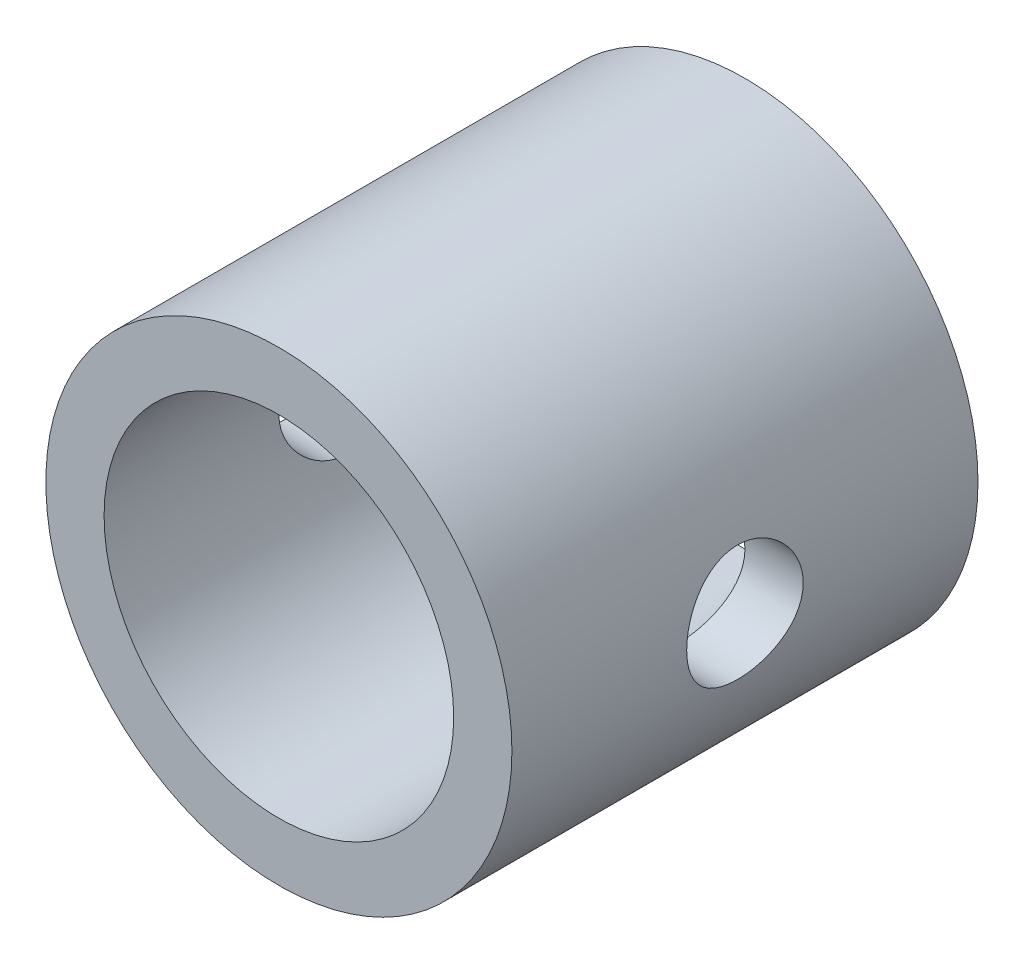
ISO-10303-21;
HEADER;
FILE_DESCRIPTION(('STEP AP214'),'2;1');
FILE_NAME('part.step','',(''),(''),'','','');
FILE_SCHEMA(('AUTOMOTIVE_DESIGN { 1 0 10303 214 1 1 1 1 }'));
ENDSEC;
DATA;
#1=APPLICATION_CONTEXT('core data for automotive mechanical design processes');
#2=APPLICATION_PROTOCOL_DEFINITION('international standard','automotive_design',2000,#1);
#3=PRODUCT_CONTEXT('',#1,'mechanical');
#4=PRODUCT('Part','Part','',(#3));
#5=PRODUCT_RELATED_PRODUCT_CATEGORY('part','',(#4));
#6=PRODUCT_DEFINITION_FORMATION('','',#4);
#7=PRODUCT_DEFINITION_CONTEXT('part definition',#1,'design');
#8=PRODUCT_DEFINITION('design','',#6,#7);
#9=PRODUCT_DEFINITION_SHAPE('','',#8);
#10=(LENGTH_UNIT() NAMED_UNIT(*) SI_UNIT(.MILLI.,.METRE.));
#11=(NAMED_UNIT(*) PLANE_ANGLE_UNIT() SI_UNIT($,.RADIAN.));
#12=(NAMED_UNIT(*) SI_UNIT($,.STERADIAN.) SOLID_ANGLE_UNIT());
#13=UNCERTAINTY_MEASURE_WITH_UNIT(LENGTH_MEASURE(1.E-05),#10,'distance_accuracy_value','');
#14=(GEOMETRIC_REPRESENTATION_CONTEXT(3) GLOBAL_UNCERTAINTY_ASSIGNED_CONTEXT((#13)) GLOBAL_UNIT_ASSIGNED_CONTEXT((#10,
#11,#12)) REPRESENTATION_CONTEXT('',''));
#15=CARTESIAN_POINT('',(0.,0.,0.));
#16=DIRECTION('',(0.,0.,1.));
#17=DIRECTION('',(1.,0.,0.));
#18=AXIS2_PLACEMENT_3D('',#15,#16,#17);
#19=CARTESIAN_POINT('',(0.,0.,20.));
#20=DIRECTION('',(0.,0.,1.));
#21=DIRECTION('',(1.,0.,0.));
#22=AXIS2_PLACEMENT_3D('',#19,#20,#21);
#23=PLANE('',#22);
#24=CARTESIAN_POINT('',(0.,0.,20.));
#25=DIRECTION('',(0.,0.,1.));
#26=DIRECTION('',(1.,0.,0.));
#27=AXIS2_PLACEMENT_3D('',#24,#25,#26);
#28=CIRCLE('',#27,10.);
#29=CARTESIAN_POINT('',(10.,0.,20.));
#30=VERTEX_POINT('',#29);
#31=EDGE_CURVE('E10',#30,#30,#28,.T.);
#32=ORIENTED_EDGE('',*,*,#31,.T.);
#33=EDGE_LOOP('',(#32));
#34=FACE_BOUND('',#33,.T.);
#35=CARTESIAN_POINT('',(0.,0.,20.));
#36=DIRECTION('',(0.,0.,1.));
#37=DIRECTION('',(1.,0.,0.));
#38=AXIS2_PLACEMENT_3D('',#35,#36,#37);
#39=CIRCLE('',#38,7.5);
#40=CARTESIAN_POINT('',(7.5,0.,20.));
#41=VERTEX_POINT('',#40);
#42=EDGE_CURVE('E49',#41,#41,#39,.T.);
#43=ORIENTED_EDGE('',*,*,#42,.F.);
#44=EDGE_LOOP('',(#43));
#45=FACE_BOUND('',#44,.T.);
#46=ADVANCED_FACE('F31',(#34,#45),#23,.T.);
#47=CARTESIAN_POINT('',(0.,0.,0.));
#48=DIRECTION('',(0.,0.,1.));
#49=DIRECTION('',(1.,0.,0.));
#50=AXIS2_PLACEMENT_3D('',#47,#48,#49);
#51=PLANE('',#50);
#52=CARTESIAN_POINT('',(0.,0.,0.));
#53=DIRECTION('',(0.,0.,1.));
#54=DIRECTION('',(1.,0.,0.));
#55=AXIS2_PLACEMENT_3D('',#52,#53,#54);
#56=CIRCLE('',#55,10.);
#57=CARTESIAN_POINT('',(10.,0.,0.));
#58=VERTEX_POINT('',#57);
#59=EDGE_CURVE('E44',#58,#58,#56,.T.);
#60=ORIENTED_EDGE('',*,*,#59,.F.);
#61=EDGE_LOOP('',(#60));
#62=FACE_BOUND('',#61,.T.);
#63=CARTESIAN_POINT('',(0.,0.,0.));
#64=DIRECTION('',(0.,0.,1.));
#65=DIRECTION('',(1.,0.,0.));
#66=AXIS2_PLACEMENT_3D('',#63,#64,#65);
#67=CIRCLE('',#66,7.5);
#68=CARTESIAN_POINT('',(7.5,0.,0.));
#69=VERTEX_POINT('',#68);
#70=EDGE_CURVE('E52',#69,#69,#67,.T.);
#71=ORIENTED_EDGE('',*,*,#70,.T.);
#72=EDGE_LOOP('',(#71));
#73=FACE_BOUND('',#72,.T.);
#74=ADVANCED_FACE('F85',(#62,#73),#51,.F.);
#75=CARTESIAN_POINT('',(0.,0.,20.));
#76=DIRECTION('',(0.,0.,-1.));
#77=DIRECTION('',(-1.,0.,0.));
#78=AXIS2_PLACEMENT_3D('',#75,#76,#77);
#79=CYLINDRICAL_SURFACE('',#78,10.);
#80=CARTESIAN_POINT('',(-10.,0.,7.50000000000001));
#81=CARTESIAN_POINT('',(-9.99999766446687,0.138126814449552,7.50000387623027));
#82=CARTESIAN_POINT('',(-9.99710963553044,0.276296929717938,7.51148591795632));
#83=CARTESIAN_POINT('',(-9.98586856383157,0.548677206284221,7.55704191884502));
#84=CARTESIAN_POINT('',(-9.97751242366627,0.682885078117899,7.59112868256309));
#85=CARTESIAN_POINT('',(-9.9562604388672,0.943368120304294,7.68073208910348));
#86=CARTESIAN_POINT('',(-9.94337004736764,1.06965260571667,7.73622299785879));
#87=CARTESIAN_POINT('',(-9.91442239679369,1.31112021984071,7.86696898340808));
#88=CARTESIAN_POINT('',(-9.89836503090261,1.4263029739146,7.94222472686495));
#89=CARTESIAN_POINT('',(-9.86445689319489,1.64466987883486,8.11200131609031));
#90=CARTESIAN_POINT('',(-9.84657845246877,1.74759281676843,8.20685262493178));
#91=CARTESIAN_POINT('',(-9.8112270019656,1.93624821200553,8.41242034151506));
#92=CARTESIAN_POINT('',(-9.79375403816446,2.02197872824865,8.5231385382449));
#93=CARTESIAN_POINT('',(-9.76091292830281,2.17504423799829,8.75932537789499));
#94=CARTESIAN_POINT('',(-9.74557990774685,2.2420870265419,8.88498871801455));
#95=CARTESIAN_POINT('',(-9.71915824696694,2.35399484758457,9.14624735276673));
#96=CARTESIAN_POINT('',(-9.70806892824031,2.39886342573357,9.28184105555336));
#97=CARTESIAN_POINT('',(-9.69167461160538,2.46425806134127,9.55623916366944));
#98=CARTESIAN_POINT('',(-9.68625818328352,2.48525378055342,9.69492482672999));
#99=CARTESIAN_POINT('',(-9.68148937432652,2.50376962511068,9.97394761499891));
#100=CARTESIAN_POINT('',(-9.68213600713214,2.50129356969685,10.1142844678202));
#101=CARTESIAN_POINT('',(-9.68932009194695,2.47331087439951,10.3890263462423));
#102=CARTESIAN_POINT('',(-9.69571438345489,2.44836390031772,10.5234927024422));
#103=CARTESIAN_POINT('',(-9.71344516118448,2.37704031150499,10.7862684181851));
#104=CARTESIAN_POINT('',(-9.72478199948731,2.33066217011565,10.9145773383815));
#105=CARTESIAN_POINT('',(-9.75125189842765,2.21731579656197,11.1628966937536));
#106=CARTESIAN_POINT('',(-9.76642212449693,2.1501444453882,11.282810286316));
#107=CARTESIAN_POINT('',(-9.79882851409985,1.99726046002491,11.5098645162614));
#108=CARTESIAN_POINT('',(-9.81606503891047,1.91154458134806,11.6170029134454));
#109=CARTESIAN_POINT('',(-9.85126467566486,1.72110570780203,11.818672692824));
#110=CARTESIAN_POINT('',(-9.86923449130002,1.61591043027643,11.9127574834356));
#111=CARTESIAN_POINT('',(-9.90343275964594,1.39101986250617,12.0820354041065));
#112=CARTESIAN_POINT('',(-9.91966115915679,1.27132412951324,12.1572279571059));
#113=CARTESIAN_POINT('',(-9.94862886823651,1.02019314780232,12.2867509770406));
#114=CARTESIAN_POINT('',(-9.96135600212879,0.888718988681039,12.3410089004241));
#115=CARTESIAN_POINT('',(-9.98179861652361,0.618126680238138,12.4265288428493));
#116=CARTESIAN_POINT('',(-9.98951505565468,0.479009998584141,12.4577952606969));
#117=CARTESIAN_POINT('',(-9.99892498785624,0.200899950650045,12.4957626092647));
#118=CARTESIAN_POINT('',(-10.0007675584713,0.0619945333136834,12.5030717101255));
#119=CARTESIAN_POINT('',(-9.99864674690754,-0.215054791335847,12.4945849965742));
#120=CARTESIAN_POINT('',(-9.99468388736421,-0.353198766074327,12.4787912620014));
#121=CARTESIAN_POINT('',(-9.98149301878918,-0.622690447960816,12.4250484860144));
#122=CARTESIAN_POINT('',(-9.97234390309647,-0.754108531614582,12.3874312275384));
#123=CARTESIAN_POINT('',(-9.94981177723595,-1.00876215408752,12.2914881932859));
#124=CARTESIAN_POINT('',(-9.93642833949965,-1.13199686505442,12.2331603261446));
#125=CARTESIAN_POINT('',(-9.9065551321037,-1.36920522404972,12.0962731185422));
#126=CARTESIAN_POINT('',(-9.89001445610999,-1.48297573639294,12.0173731460057));
#127=CARTESIAN_POINT('',(-9.85574181979586,-1.69587768940551,11.8420168186714));
#128=CARTESIAN_POINT('',(-9.83800965421578,-1.79500659828874,11.7455574339706));
#129=CARTESIAN_POINT('',(-9.80281594932498,-1.97831761345414,11.5349967319272));
#130=CARTESIAN_POINT('',(-9.78537173637463,-2.06207311270184,11.4205204950007));
#131=CARTESIAN_POINT('',(-9.75321463970069,-2.20918459835604,11.1787789425524));
#132=CARTESIAN_POINT('',(-9.73850163474941,-2.27254149026901,11.0515141950493));
#133=CARTESIAN_POINT('',(-9.71363491194665,-2.37658570101223,10.7884904626563));
#134=CARTESIAN_POINT('',(-9.70345425375809,-2.41740732773931,10.6527872861462));
#135=CARTESIAN_POINT('',(-9.68877906706586,-2.47557609990489,10.3761506035745));
#136=CARTESIAN_POINT('',(-9.68428329504044,-2.49292837912652,10.2352182482976));
#137=CARTESIAN_POINT('',(-9.68158168701612,-2.50339765056083,9.95646496023066));
#138=CARTESIAN_POINT('',(-9.68319887888035,-2.49719649630131,9.81867094145593));
#139=CARTESIAN_POINT('',(-9.69213181672143,-2.46229546385366,9.54616018555623));
#140=CARTESIAN_POINT('',(-9.69944744817731,-2.43359603781098,9.41144338664468));
#141=CARTESIAN_POINT('',(-9.71885434473222,-2.35488553240495,9.14965256822357));
#142=CARTESIAN_POINT('',(-9.73091692061057,-2.30500234113404,9.02253782459946));
#143=CARTESIAN_POINT('',(-9.7584625954084,-2.18544152267504,8.77839102881073));
#144=CARTESIAN_POINT('',(-9.77394616867808,-2.11576115005696,8.66136037802187));
#145=CARTESIAN_POINT('',(-9.80709390439338,-1.95644624772858,8.43740895166325));
#146=CARTESIAN_POINT('',(-9.82480441386302,-1.86633860485376,8.33083154429339));
#147=CARTESIAN_POINT('',(-9.86013378743769,-1.66964895198289,8.13408825867434));
#148=CARTESIAN_POINT('',(-9.87775262878422,-1.56306303543524,8.04392628314506));
#149=CARTESIAN_POINT('',(-9.91129426079449,-1.33411264450432,7.88098115239232));
#150=CARTESIAN_POINT('',(-9.92718055609783,-1.21149737052731,7.80854231054738));
#151=CARTESIAN_POINT('',(-9.95508208291861,-0.95544343251746,7.68542089509913));
#152=CARTESIAN_POINT('',(-9.96710008666301,-0.822012605727899,7.63472273225245));
#153=CARTESIAN_POINT('',(-9.98413432609236,-0.57401708873912,7.56404694945058));
#154=CARTESIAN_POINT('',(-9.99004308421151,-0.460633618180114,7.54008126157762));
#155=CARTESIAN_POINT('',(-9.9979767538658,-0.231510119227139,7.5080567606301));
#156=CARTESIAN_POINT('',(-10.0000019575149,-0.115770268737694,7.49999675115784));
#157=CARTESIAN_POINT('',(-10.,0.,7.50000000000001));
#158=B_SPLINE_CURVE_WITH_KNOTS('',3,(#80,#81,#82,#83,#84,#85,#86,#87,#88,#89,#90,#91,#92,#93,
#94,#95,#96,#97,#98,#99,#100,#101,#102,#103,#104,#105,#106,#107,#108,#109,#110,#111,#112,#113,
#114,#115,#116,#117,#118,#119,#120,#121,#122,#123,#124,#125,#126,#127,#128,#129,#130,#131,#132,
#133,#134,#135,#136,#137,#138,#139,#140,#141,#142,#143,#144,#145,#146,#147,#148,#149,#150,#151,
#152,#153,#154,#155,#156,#157),.UNSPECIFIED.,.T.,.F.,(4,2,2,2,2,2,2,2,2,2,2,2,2,2,2,2,2,2,2,2,2,
2,2,2,2,2,2,2,2,2,2,2,2,2,2,2,2,2,4),(0.,0.413956187453149,0.828147062939832,1.24184150381018,
1.65554990028221,2.07690725728565,2.4983121596677,2.92597745909678,3.3535743528228,
3.77260491835116,4.19156730193362,4.60037495017231,5.00921172448931,5.42217546461999,
5.83521151399139,6.26002501620566,6.68485149269279,7.11113715020724,7.53734122819939,
7.95263848254328,8.36789835193438,8.77700457528929,9.18615212209351,9.6025597928112,
10.0190393835223,10.4457418201299,10.8724253125471,11.2965375769763,11.7205570543048,
12.1323963400748,12.5442273493652,12.9536066760887,13.3630428023796,13.7831596069298,
14.2033761629383,14.6312030917578,15.0587227304538,15.4057040491338,15.7526592674819),.UNSPECIFIED.);
#159=CARTESIAN_POINT('',(-10.,0.,7.50000000000001));
#160=VERTEX_POINT('',#159);
#161=EDGE_CURVE('E75',#160,#160,#158,.T.);
#162=ORIENTED_EDGE('',*,*,#161,.T.);
#163=EDGE_LOOP('',(#162));
#164=FACE_BOUND('',#163,.T.);
#165=CARTESIAN_POINT('',(10.,0.,7.50000000000001));
#166=CARTESIAN_POINT('',(9.99999766446687,-0.138126814449552,7.50000387623027));
#167=CARTESIAN_POINT('',(9.99710963553044,-0.276296929717938,7.51148591795632));
#168=CARTESIAN_POINT('',(9.98586856383157,-0.548677206284221,7.55704191884502));
#169=CARTESIAN_POINT('',(9.97751242366627,-0.682885078117899,7.59112868256309));
#170=CARTESIAN_POINT('',(9.9562604388672,-0.943368120304294,7.68073208910348));
#171=CARTESIAN_POINT('',(9.94337004736764,-1.06965260571667,7.73622299785879));
#172=CARTESIAN_POINT('',(9.91442239679369,-1.31112021984071,7.86696898340808));
#173=CARTESIAN_POINT('',(9.89836503090261,-1.4263029739146,7.94222472686495));
#174=CARTESIAN_POINT('',(9.86445689319489,-1.64466987883486,8.11200131609031));
#175=CARTESIAN_POINT('',(9.84657845246877,-1.74759281676843,8.20685262493178));
#176=CARTESIAN_POINT('',(9.8112270019656,-1.93624821200553,8.41242034151506));
#177=CARTESIAN_POINT('',(9.79375403816446,-2.02197872824865,8.5231385382449));
#178=CARTESIAN_POINT('',(9.76091292830281,-2.17504423799829,8.75932537789499));
#179=CARTESIAN_POINT('',(9.74557990774685,-2.2420870265419,8.88498871801455));
#180=CARTESIAN_POINT('',(9.71915824696694,-2.35399484758457,9.14624735276673));
#181=CARTESIAN_POINT('',(9.70806892824031,-2.39886342573357,9.28184105555336));
#182=CARTESIAN_POINT('',(9.69167461160538,-2.46425806134127,9.55623916366944));
#183=CARTESIAN_POINT('',(9.68625818328352,-2.48525378055342,9.69492482672999));
#184=CARTESIAN_POINT('',(9.68148937432652,-2.50376962511068,9.97394761499891));
#185=CARTESIAN_POINT('',(9.68213600713214,-2.50129356969685,10.1142844678202));
#186=CARTESIAN_POINT('',(9.68932009194695,-2.47331087439951,10.3890263462423));
#187=CARTESIAN_POINT('',(9.69571438345489,-2.44836390031772,10.5234927024422));
#188=CARTESIAN_POINT('',(9.71344516118448,-2.37704031150499,10.7862684181851));
#189=CARTESIAN_POINT('',(9.72478199948731,-2.33066217011565,10.9145773383815));
#190=CARTESIAN_POINT('',(9.75125189842765,-2.21731579656197,11.1628966937536));
#191=CARTESIAN_POINT('',(9.76642212449693,-2.1501444453882,11.282810286316));
#192=CARTESIAN_POINT('',(9.79882851409985,-1.99726046002491,11.5098645162614));
#193=CARTESIAN_POINT('',(9.81606503891047,-1.91154458134806,11.6170029134454));
#194=CARTESIAN_POINT('',(9.85126467566486,-1.72110570780203,11.818672692824));
#195=CARTESIAN_POINT('',(9.86923449130002,-1.61591043027643,11.9127574834356));
#196=CARTESIAN_POINT('',(9.90343275964594,-1.39101986250617,12.0820354041065));
#197=CARTESIAN_POINT('',(9.91966115915679,-1.27132412951324,12.1572279571059));
#198=CARTESIAN_POINT('',(9.94862886823651,-1.02019314780232,12.2867509770406));
#199=CARTESIAN_POINT('',(9.96135600212879,-0.888718988681039,12.3410089004241));
#200=CARTESIAN_POINT('',(9.98179861652361,-0.618126680238138,12.4265288428493));
#201=CARTESIAN_POINT('',(9.98951505565468,-0.479009998584141,12.4577952606969));
#202=CARTESIAN_POINT('',(9.99892498785624,-0.200899950650045,12.4957626092647));
#203=CARTESIAN_POINT('',(10.0007675584713,-0.0619945333136834,12.5030717101255));
#204=CARTESIAN_POINT('',(9.99864674690754,0.215054791335847,12.4945849965742));
#205=CARTESIAN_POINT('',(9.99468388736421,0.353198766074327,12.4787912620014));
#206=CARTESIAN_POINT('',(9.98149301878918,0.622690447960816,12.4250484860144));
#207=CARTESIAN_POINT('',(9.97234390309647,0.754108531614582,12.3874312275384));
#208=CARTESIAN_POINT('',(9.94981177723595,1.00876215408752,12.2914881932859));
#209=CARTESIAN_POINT('',(9.93642833949965,1.13199686505442,12.2331603261446));
#210=CARTESIAN_POINT('',(9.9065551321037,1.36920522404972,12.0962731185422));
#211=CARTESIAN_POINT('',(9.89001445610999,1.48297573639294,12.0173731460057));
#212=CARTESIAN_POINT('',(9.85574181979586,1.69587768940551,11.8420168186714));
#213=CARTESIAN_POINT('',(9.83800965421578,1.79500659828874,11.7455574339706));
#214=CARTESIAN_POINT('',(9.80281594932498,1.97831761345414,11.5349967319272));
#215=CARTESIAN_POINT('',(9.78537173637463,2.06207311270184,11.4205204950007));
#216=CARTESIAN_POINT('',(9.75321463970069,2.20918459835604,11.1787789425524));
#217=CARTESIAN_POINT('',(9.73850163474941,2.27254149026901,11.0515141950493));
#218=CARTESIAN_POINT('',(9.71363491194665,2.37658570101223,10.7884904626563));
#219=CARTESIAN_POINT('',(9.70345425375809,2.41740732773931,10.6527872861462));
#220=CARTESIAN_POINT('',(9.68877906706586,2.47557609990489,10.3761506035745));
#221=CARTESIAN_POINT('',(9.68428329504044,2.49292837912652,10.2352182482976));
#222=CARTESIAN_POINT('',(9.68158168701612,2.50339765056083,9.95646496023066));
#223=CARTESIAN_POINT('',(9.68319887888035,2.49719649630131,9.81867094145593));
#224=CARTESIAN_POINT('',(9.69213181672143,2.46229546385366,9.54616018555623));
#225=CARTESIAN_POINT('',(9.69944744817731,2.43359603781098,9.41144338664468));
#226=CARTESIAN_POINT('',(9.71885434473222,2.35488553240495,9.14965256822357));
#227=CARTESIAN_POINT('',(9.73091692061057,2.30500234113404,9.02253782459946));
#228=CARTESIAN_POINT('',(9.7584625954084,2.18544152267504,8.77839102881073));
#229=CARTESIAN_POINT('',(9.77394616867808,2.11576115005696,8.66136037802187));
#230=CARTESIAN_POINT('',(9.80709390439338,1.95644624772858,8.43740895166325));
#231=CARTESIAN_POINT('',(9.82480441386302,1.86633860485376,8.33083154429339));
#232=CARTESIAN_POINT('',(9.86013378743769,1.66964895198289,8.13408825867434));
#233=CARTESIAN_POINT('',(9.87775262878422,1.56306303543524,8.04392628314506));
#234=CARTESIAN_POINT('',(9.91129426079449,1.33411264450432,7.88098115239232));
#235=CARTESIAN_POINT('',(9.92718055609783,1.21149737052731,7.80854231054738));
#236=CARTESIAN_POINT('',(9.95508208291861,0.95544343251746,7.68542089509913));
#237=CARTESIAN_POINT('',(9.96710008666301,0.822012605727899,7.63472273225245));
#238=CARTESIAN_POINT('',(9.98413432609236,0.57401708873912,7.56404694945058));
#239=CARTESIAN_POINT('',(9.99004308421151,0.460633618180114,7.54008126157762));
#240=CARTESIAN_POINT('',(9.9979767538658,0.231510119227139,7.5080567606301));
#241=CARTESIAN_POINT('',(10.0000019575149,0.115770268737694,7.49999675115784));
#242=CARTESIAN_POINT('',(10.,0.,7.50000000000001));
#243=B_SPLINE_CURVE_WITH_KNOTS('',3,(#165,#166,#167,#168,#169,#170,#171,#172,#173,#174,#175,
#176,#177,#178,#179,#180,#181,#182,#183,#184,#185,#186,#187,#188,#189,#190,#191,#192,#193,#194,
#195,#196,#197,#198,#199,#200,#201,#202,#203,#204,#205,#206,#207,#208,#209,#210,#211,#212,#213,
#214,#215,#216,#217,#218,#219,#220,#221,#222,#223,#224,#225,#226,#227,#228,#229,#230,#231,#232,
#233,#234,#235,#236,#237,#238,#239,#240,#241,#242),.UNSPECIFIED.,.T.,.F.,(4,2,2,2,2,2,2,2,2,2,2,
2,2,2,2,2,2,2,2,2,2,2,2,2,2,2,2,2,2,2,2,2,2,2,2,2,2,2,4),(0.,0.413956187453149,
0.828147062939832,1.24184150381018,1.65554990028221,2.07690725728565,2.4983121596677,
2.92597745909678,3.3535743528228,3.77260491835116,4.19156730193362,4.60037495017231,
5.00921172448931,5.42217546461999,5.83521151399139,6.26002501620566,6.68485149269279,
7.11113715020724,7.53734122819939,7.95263848254328,8.36789835193438,8.77700457528929,
9.18615212209351,9.6025597928112,10.0190393835223,10.4457418201299,10.8724253125471,
11.2965375769763,11.7205570543048,12.1323963400748,12.5442273493652,12.9536066760887,
13.3630428023796,13.7831596069298,14.2033761629383,14.6312030917578,15.0587227304538,
15.4057040491338,15.7526592674819),.UNSPECIFIED.);
#244=CARTESIAN_POINT('',(10.,0.,7.50000000000001));
#245=VERTEX_POINT('',#244);
#246=EDGE_CURVE('E71',#245,#245,#243,.T.);
#247=ORIENTED_EDGE('',*,*,#246,.T.);
#248=EDGE_LOOP('',(#247));
#249=FACE_BOUND('',#248,.T.);
#250=ORIENTED_EDGE('',*,*,#31,.F.);
#251=EDGE_LOOP('',(#250));
#252=FACE_BOUND('',#251,.T.);
#253=ORIENTED_EDGE('',*,*,#59,.T.);
#254=EDGE_LOOP('',(#253));
#255=FACE_BOUND('',#254,.T.);
#256=ADVANCED_FACE('F33',(#164,#249,#252,#255),#79,.T.);
#257=CARTESIAN_POINT('',(0.,0.,20.));
#258=DIRECTION('',(0.,0.,-1.));
#259=DIRECTION('',(-1.,0.,0.));
#260=AXIS2_PLACEMENT_3D('',#257,#258,#259);
#261=CYLINDRICAL_SURFACE('',#260,7.5);
#262=CARTESIAN_POINT('',(-7.5,0.,12.5));
#263=CARTESIAN_POINT('',(-7.5000003825236,-0.136408407216808,12.5000006343291));
#264=CARTESIAN_POINT('',(-7.49624423768862,-0.272812986346375,12.488799334682));
#265=CARTESIAN_POINT('',(-7.48163025508202,-0.54160440218243,12.444427227957));
#266=CARTESIAN_POINT('',(-7.47077168005381,-0.673990820297044,12.4112541401277));
#267=CARTESIAN_POINT('',(-7.44313269766107,-0.93083197375444,12.3242018915399));
#268=CARTESIAN_POINT('',(-7.42636219327133,-1.05529956471509,12.2703573438518));
#269=CARTESIAN_POINT('',(-7.38861114293354,-1.29343734201331,12.1436470679041));
#270=CARTESIAN_POINT('',(-7.36762976669445,-1.40710539239676,12.0707775874935));
#271=CARTESIAN_POINT('',(-7.32285236107513,-1.62435418755566,11.9054354878531));
#272=CARTESIAN_POINT('',(-7.29898891159462,-1.72750925074577,11.8124219143488));
#273=CARTESIAN_POINT('',(-7.25150786957804,-1.91708173175521,11.6105821132336));
#274=CARTESIAN_POINT('',(-7.22789033226373,-2.00349546372365,11.5017524126787));
#275=CARTESIAN_POINT('',(-7.18283331193184,-2.15956235556965,11.2675372120089));
#276=CARTESIAN_POINT('',(-7.1614759818922,-2.22866214555258,11.1417656506697));
#277=CARTESIAN_POINT('',(-7.12438263546503,-2.3445471846943,10.8795597638536));
#278=CARTESIAN_POINT('',(-7.10864490401864,-2.39133924346691,10.7431287070931));
#279=CARTESIAN_POINT('',(-7.08528258173443,-2.45968365377291,10.4683169462582));
#280=CARTESIAN_POINT('',(-7.07740239424028,-2.48203362067942,10.3301569787773));
#281=CARTESIAN_POINT('',(-7.06989141573769,-2.50335280833619,10.0518406146103));
#282=CARTESIAN_POINT('',(-7.07025807556825,-2.50232925401179,9.91168484822703));
#283=CARTESIAN_POINT('',(-7.0789753752045,-2.47754975925855,9.64015842388995));
#284=CARTESIAN_POINT('',(-7.08696039668832,-2.45483478291749,9.50867899270246));
#285=CARTESIAN_POINT('',(-7.10941644311377,-2.38901540712354,9.25151645098292));
#286=CARTESIAN_POINT('',(-7.12388824460269,-2.34590856647968,9.12583403641233));
#287=CARTESIAN_POINT('',(-7.15794777828122,-2.23984764515053,8.88146812602131));
#288=CARTESIAN_POINT('',(-7.17761414482793,-2.17658512176815,8.76292993632619));
#289=CARTESIAN_POINT('',(-7.21981396439316,-2.03222276575785,8.53782272930069));
#290=CARTESIAN_POINT('',(-7.24234824476159,-1.95111778091001,8.43125718266655));
#291=CARTESIAN_POINT('',(-7.28918322919352,-1.76837333170559,8.22727100459807));
#292=CARTESIAN_POINT('',(-7.31351473387107,-1.66588287519078,8.13061826372733));
#293=CARTESIAN_POINT('',(-7.36017345967592,-1.44584892492516,7.95567183334151));
#294=CARTESIAN_POINT('',(-7.38250048845168,-1.32830398915204,7.87737990458877));
#295=CARTESIAN_POINT('',(-7.42292769844484,-1.07986903261567,7.74075924941233));
#296=CARTESIAN_POINT('',(-7.44098375020098,-0.948858191040841,7.68263627164818));
#297=CARTESIAN_POINT('',(-7.47051417861087,-0.678172708411268,7.58949206511073));
#298=CARTESIAN_POINT('',(-7.48199084137198,-0.538501095387384,7.55446281144141));
#299=CARTESIAN_POINT('',(-7.49669067678601,-0.26095957382326,7.50986083494411));
#300=CARTESIAN_POINT('',(-7.5002500458432,-0.123273999662115,7.49925047706813));
#301=CARTESIAN_POINT('',(-7.49972256737068,0.151937674900594,7.50083168399618));
#302=CARTESIAN_POINT('',(-7.49563701048406,0.289463798299126,7.5130193999497));
#303=CARTESIAN_POINT('',(-7.48050061792761,0.556299665760639,7.5590297693399));
#304=CARTESIAN_POINT('',(-7.46965496777981,0.685732017087109,7.59221551512374));
#305=CARTESIAN_POINT('',(-7.44229617075175,0.937139896448934,7.67848361116683));
#306=CARTESIAN_POINT('',(-7.42578230116688,1.05911447127152,7.73156849866947));
#307=CARTESIAN_POINT('',(-7.38822328218224,1.29572074098318,7.85767607960197));
#308=CARTESIAN_POINT('',(-7.36707036889465,1.41007489804287,7.93118648320793));
#309=CARTESIAN_POINT('',(-7.32263134790656,1.62516207533896,8.09548537503372));
#310=CARTESIAN_POINT('',(-7.29934458984569,1.72589091948894,8.18627914007942));
#311=CARTESIAN_POINT('',(-7.25192119951112,1.91563126951575,8.38744687751648));
#312=CARTESIAN_POINT('',(-7.2277940271857,2.00390242311443,8.49852306731716));
#313=CARTESIAN_POINT('',(-7.18249933236772,2.16064380580894,8.73442891952722));
#314=CARTESIAN_POINT('',(-7.16133183455006,2.22911386982753,8.8592586965852));
#315=CARTESIAN_POINT('',(-7.12455979478459,2.3439923260409,9.11918253822475));
#316=CARTESIAN_POINT('',(-7.10894401982447,2.39044533041255,9.25425519792192));
#317=CARTESIAN_POINT('',(-7.08527080766124,2.45973666689839,9.53094662511033));
#318=CARTESIAN_POINT('',(-7.07720996559098,2.48258563738485,9.67256241351088));
#319=CARTESIAN_POINT('',(-7.06994647185443,2.50319070619335,9.95049274010229));
#320=CARTESIAN_POINT('',(-7.07031000643538,2.502175643271,10.0867058507171));
#321=CARTESIAN_POINT('',(-7.07878174559669,2.47810573362173,10.3569126873052));
#322=CARTESIAN_POINT('',(-7.08688948923404,2.45505219864646,10.4909065448877));
#323=CARTESIAN_POINT('',(-7.10961310762229,2.38842953282336,10.7503391575062));
#324=CARTESIAN_POINT('',(-7.12410245056194,2.34525836503878,10.8758920625112));
#325=CARTESIAN_POINT('',(-7.15790997046171,2.23994841439937,11.1180685173457));
#326=CARTESIAN_POINT('',(-7.17722921908483,2.17780542138451,11.23469007797));
#327=CARTESIAN_POINT('',(-7.21957073065116,2.03315173145857,11.4612091748073));
#328=CARTESIAN_POINT('',(-7.24271779105343,1.94987060691145,11.570591254746));
#329=CARTESIAN_POINT('',(-7.28958390708132,1.76660720783912,11.7742245334605));
#330=CARTESIAN_POINT('',(-7.31330312280931,1.6666202111287,11.8684714392202));
#331=CARTESIAN_POINT('',(-7.3597507631386,1.44810389230172,12.0428610307229));
#332=CARTESIAN_POINT('',(-7.38240454503142,1.32900378374932,12.1223108693775));
#333=CARTESIAN_POINT('',(-7.4231497793153,1.07839339351656,12.2599760721266));
#334=CARTESIAN_POINT('',(-7.44124239769824,0.946886295330872,12.3181968648051));
#335=CARTESIAN_POINT('',(-7.47013787671354,0.68123411800244,12.4093040812217));
#336=CARTESIAN_POINT('',(-7.48123031056307,0.547469394191022,12.4432061656584));
#337=CARTESIAN_POINT('',(-7.49616017660555,0.275801040025618,12.4885507016928));
#338=CARTESIAN_POINT('',(-7.49999961329762,0.137898563921866,12.4999993587413));
#339=CARTESIAN_POINT('',(-7.5,0.,12.5));
#340=B_SPLINE_CURVE_WITH_KNOTS('',3,(#262,#263,#264,#265,#266,#267,#268,#269,#270,#271,#272,
#273,#274,#275,#276,#277,#278,#279,#280,#281,#282,#283,#284,#285,#286,#287,#288,#289,#290,#291,
#292,#293,#294,#295,#296,#297,#298,#299,#300,#301,#302,#303,#304,#305,#306,#307,#308,#309,#310,
#311,#312,#313,#314,#315,#316,#317,#318,#319,#320,#321,#322,#323,#324,#325,#326,#327,#328,#329,
#330,#331,#332,#333,#334,#335,#336,#337,#338,#339),.UNSPECIFIED.,.T.,.F.,(4,2,2,2,2,2,2,2,2,2,2,
2,2,2,2,2,2,2,2,2,2,2,2,2,2,2,2,2,2,2,2,2,2,2,2,2,2,2,4),(0.,0.408717765065027,
0.817477963168801,1.22555668217568,1.63371594449775,2.0546171070689,2.47561083218825,
2.90870962058676,3.34167611732083,3.760048143546,4.17829084968713,4.577420663782,
4.97659827138705,5.38220427887826,5.78792756395518,6.21483264528417,6.64177864916546,
7.07296014125894,7.5039917219302,7.91633957937924,8.32861782910441,8.72895394945533,
9.12934113210259,9.54025999609341,9.95130452054727,10.3810255720188,10.8107502058749,
11.2396003456693,11.668257117646,12.0748916516064,12.4815019837844,12.8803896770104,
13.2793659543994,13.6957516672951,14.1122552780945,14.5449915208775,14.9776170288114,
15.3909139593453,15.8040966509535),.UNSPECIFIED.);
#341=CARTESIAN_POINT('',(-7.5,0.,12.5));
#342=VERTEX_POINT('',#341);
#343=EDGE_CURVE('E36',#342,#342,#340,.T.);
#344=ORIENTED_EDGE('',*,*,#343,.F.);
#345=EDGE_LOOP('',(#344));
#346=FACE_BOUND('',#345,.T.);
#347=CARTESIAN_POINT('',(7.5,0.,7.50000000000001));
#348=CARTESIAN_POINT('',(7.5000003825236,-0.136408407216808,7.4999993656709));
#349=CARTESIAN_POINT('',(7.49624423768862,-0.272812986346374,7.51120066531805));
#350=CARTESIAN_POINT('',(7.48163025508202,-0.54160440218243,7.55557277204305));
#351=CARTESIAN_POINT('',(7.47077168005381,-0.673990820297044,7.58874585987231));
#352=CARTESIAN_POINT('',(7.44313269766107,-0.930831973754439,7.67579810846013));
#353=CARTESIAN_POINT('',(7.42636219327133,-1.05529956471508,7.72964265614819));
#354=CARTESIAN_POINT('',(7.38861114293354,-1.29343734201331,7.85635293209587));
#355=CARTESIAN_POINT('',(7.36762976669445,-1.40710539239676,7.92922241250651));
#356=CARTESIAN_POINT('',(7.32285236107513,-1.62435418755566,8.09456451214689));
#357=CARTESIAN_POINT('',(7.29898891159462,-1.72750925074577,8.18757808565124));
#358=CARTESIAN_POINT('',(7.25150786957804,-1.91708173175521,8.38941788676642));
#359=CARTESIAN_POINT('',(7.22789033226373,-2.00349546372366,8.49824758732129));
#360=CARTESIAN_POINT('',(7.18283331193184,-2.15956235556965,8.73246278799115));
#361=CARTESIAN_POINT('',(7.1614759818922,-2.22866214555258,8.85823434933031));
#362=CARTESIAN_POINT('',(7.12438263546503,-2.3445471846943,9.12044023614637));
#363=CARTESIAN_POINT('',(7.10864490401864,-2.39133924346691,9.25687129290687));
#364=CARTESIAN_POINT('',(7.08528258173443,-2.45968365377291,9.53168305374178));
#365=CARTESIAN_POINT('',(7.07740239424028,-2.48203362067942,9.66984302122266));
#366=CARTESIAN_POINT('',(7.06989141573769,-2.50335280833619,9.94815938538971));
#367=CARTESIAN_POINT('',(7.07025807556825,-2.50232925401179,10.088315151773));
#368=CARTESIAN_POINT('',(7.0789753752045,-2.47754975925855,10.3598415761101));
#369=CARTESIAN_POINT('',(7.08696039668832,-2.45483478291749,10.4913210072976));
#370=CARTESIAN_POINT('',(7.10941644311377,-2.38901540712354,10.7484835490171));
#371=CARTESIAN_POINT('',(7.12388824460269,-2.34590856647968,10.8741659635877));
#372=CARTESIAN_POINT('',(7.15794777828122,-2.23984764515053,11.1185318739787));
#373=CARTESIAN_POINT('',(7.17761414482793,-2.17658512176815,11.2370700636738));
#374=CARTESIAN_POINT('',(7.21981396439316,-2.03222276575785,11.4621772706993));
#375=CARTESIAN_POINT('',(7.24234824476159,-1.95111778091001,11.5687428173335));
#376=CARTESIAN_POINT('',(7.28918322919352,-1.76837333170559,11.7727289954019));
#377=CARTESIAN_POINT('',(7.31351473387107,-1.66588287519078,11.8693817362727));
#378=CARTESIAN_POINT('',(7.36017345967592,-1.44584892492516,12.0443281666585));
#379=CARTESIAN_POINT('',(7.38250048845168,-1.32830398915203,12.1226200954112));
#380=CARTESIAN_POINT('',(7.42292769844484,-1.07986903261567,12.2592407505877));
#381=CARTESIAN_POINT('',(7.44098375020098,-0.94885819104084,12.3173637283518));
#382=CARTESIAN_POINT('',(7.47051417861087,-0.678172708411267,12.4105079348893));
#383=CARTESIAN_POINT('',(7.48199084137198,-0.538501095387382,12.4455371885586));
#384=CARTESIAN_POINT('',(7.49669067678601,-0.260959573823259,12.4901391650559));
#385=CARTESIAN_POINT('',(7.5002500458432,-0.123273999662114,12.5007495229319));
#386=CARTESIAN_POINT('',(7.49972256737068,0.151937674900594,12.4991683160038));
#387=CARTESIAN_POINT('',(7.49563701048406,0.289463798299127,12.4869806000503));
#388=CARTESIAN_POINT('',(7.48050061792761,0.556299665760639,12.4409702306601));
#389=CARTESIAN_POINT('',(7.46965496777981,0.685732017087109,12.4077844848763));
#390=CARTESIAN_POINT('',(7.44229617075175,0.937139896448934,12.3215163888332));
#391=CARTESIAN_POINT('',(7.42578230116688,1.05911447127152,12.2684315013305));
#392=CARTESIAN_POINT('',(7.38822328218224,1.29572074098318,12.142323920398));
#393=CARTESIAN_POINT('',(7.36707036889465,1.41007489804287,12.0688135167921));
#394=CARTESIAN_POINT('',(7.32263134790656,1.62516207533897,11.9045146249663));
#395=CARTESIAN_POINT('',(7.29934458984569,1.72589091948894,11.8137208599206));
#396=CARTESIAN_POINT('',(7.25192119951112,1.91563126951575,11.6125531224835));
#397=CARTESIAN_POINT('',(7.2277940271857,2.00390242311443,11.5014769326829));
#398=CARTESIAN_POINT('',(7.18249933236772,2.16064380580894,11.2655710804728));
#399=CARTESIAN_POINT('',(7.16133183455006,2.22911386982753,11.1407413034148));
#400=CARTESIAN_POINT('',(7.12455979478459,2.3439923260409,10.8808174617753));
#401=CARTESIAN_POINT('',(7.10894401982447,2.39044533041255,10.7457448020781));
#402=CARTESIAN_POINT('',(7.08527080766124,2.45973666689839,10.4690533748897));
#403=CARTESIAN_POINT('',(7.07720996559098,2.48258563738485,10.3274375864891));
#404=CARTESIAN_POINT('',(7.06994647185443,2.50319070619335,10.0495072598977));
#405=CARTESIAN_POINT('',(7.07031000643538,2.502175643271,9.91329414928295));
#406=CARTESIAN_POINT('',(7.07878174559669,2.47810573362173,9.64308731269485));
#407=CARTESIAN_POINT('',(7.08688948923404,2.45505219864646,9.50909345511228));
#408=CARTESIAN_POINT('',(7.10961310762229,2.38842953282336,9.24966084249383));
#409=CARTESIAN_POINT('',(7.12410245056194,2.34525836503878,9.12410793748876));
#410=CARTESIAN_POINT('',(7.15790997046171,2.23994841439937,8.88193148265433));
#411=CARTESIAN_POINT('',(7.17722921908483,2.17780542138451,8.76530992202999));
#412=CARTESIAN_POINT('',(7.21957073065116,2.03315173145857,8.53879082519273));
#413=CARTESIAN_POINT('',(7.24271779105343,1.94987060691145,8.42940874525404));
#414=CARTESIAN_POINT('',(7.28958390708132,1.76660720783912,8.22577546653951));
#415=CARTESIAN_POINT('',(7.31330312280931,1.6666202111287,8.13152856077982));
#416=CARTESIAN_POINT('',(7.3597507631386,1.44810389230172,7.95713896927706));
#417=CARTESIAN_POINT('',(7.38240454503142,1.32900378374932,7.87768913062251));
#418=CARTESIAN_POINT('',(7.4231497793153,1.07839339351656,7.74002392787339));
#419=CARTESIAN_POINT('',(7.44124239769825,0.94688629533087,7.6818031351949));
#420=CARTESIAN_POINT('',(7.47013787671355,0.681234118002438,7.59069591877833));
#421=CARTESIAN_POINT('',(7.48123031056307,0.54746939419102,7.55679383434157));
#422=CARTESIAN_POINT('',(7.49616017660554,0.275801040025617,7.51144929830719));
#423=CARTESIAN_POINT('',(7.49999961329762,0.137898563921866,7.50000064125866));
#424=CARTESIAN_POINT('',(7.5,0.,7.50000000000001));
#425=B_SPLINE_CURVE_WITH_KNOTS('',3,(#347,#348,#349,#350,#351,#352,#353,#354,#355,#356,#357,
#358,#359,#360,#361,#362,#363,#364,#365,#366,#367,#368,#369,#370,#371,#372,#373,#374,#375,#376,
#377,#378,#379,#380,#381,#382,#383,#384,#385,#386,#387,#388,#389,#390,#391,#392,#393,#394,#395,
#396,#397,#398,#399,#400,#401,#402,#403,#404,#405,#406,#407,#408,#409,#410,#411,#412,#413,#414,
#415,#416,#417,#418,#419,#420,#421,#422,#423,#424),.UNSPECIFIED.,.T.,.F.,(4,2,2,2,2,2,2,2,2,2,2,
2,2,2,2,2,2,2,2,2,2,2,2,2,2,2,2,2,2,2,2,2,2,2,2,2,2,2,4),(0.,0.408717765065027,
0.817477963168801,1.22555668217568,1.63371594449775,2.0546171070689,2.47561083218825,
2.90870962058676,3.34167611732083,3.760048143546,4.17829084968714,4.57742066378201,
4.97659827138705,5.38220427887826,5.78792756395518,6.21483264528417,6.64177864916546,
7.07296014125894,7.5039917219302,7.91633957937924,8.32861782910441,8.72895394945533,
9.12934113210259,9.54025999609341,9.95130452054728,10.3810255720188,10.8107502058749,
11.2396003456693,11.668257117646,12.0748916516064,12.4815019837844,12.8803896770104,
13.2793659543994,13.6957516672951,14.1122552780945,14.5449915208775,14.9776170288114,
15.3909139593453,15.8040966509535),.UNSPECIFIED.);
#426=CARTESIAN_POINT('',(7.5,0.,7.50000000000001));
#427=VERTEX_POINT('',#426);
#428=EDGE_CURVE('E54',#427,#427,#425,.T.);
#429=ORIENTED_EDGE('',*,*,#428,.F.);
#430=EDGE_LOOP('',(#429));
#431=FACE_BOUND('',#430,.T.);
#432=ORIENTED_EDGE('',*,*,#42,.T.);
#433=EDGE_LOOP('',(#432));
#434=FACE_BOUND('',#433,.T.);
#435=ORIENTED_EDGE('',*,*,#70,.F.);
#436=EDGE_LOOP('',(#435));
#437=FACE_BOUND('',#436,.T.);
#438=ADVANCED_FACE('F58',(#346,#431,#434,#437),#261,.F.);
#439=CARTESIAN_POINT('',(-10.,0.,10.));
#440=DIRECTION('',(1.,0.,0.));
#441=DIRECTION('',(0.,0.,-1.));
#442=AXIS2_PLACEMENT_3D('',#439,#440,#441);
#443=CYLINDRICAL_SURFACE('',#442,2.5);
#444=ORIENTED_EDGE('',*,*,#428,.T.);
#445=EDGE_LOOP('',(#444));
#446=FACE_BOUND('',#445,.T.);
#447=ORIENTED_EDGE('',*,*,#246,.F.);
#448=EDGE_LOOP('',(#447));
#449=FACE_BOUND('',#448,.T.);
#450=ADVANCED_FACE('F64',(#446,#449),#443,.F.);
#451=ORIENTED_EDGE('',*,*,#343,.T.);
#452=EDGE_LOOP('',(#451));
#453=FACE_BOUND('',#452,.T.);
#454=ORIENTED_EDGE('',*,*,#161,.F.);
#455=EDGE_LOOP('',(#454));
#456=FACE_BOUND('',#455,.T.);
#457=ADVANCED_FACE('F61',(#453,#456),#443,.F.);
#458=CLOSED_SHELL('',(#46,#74,#256,#438,#450,#457));
#459=MANIFOLD_SOLID_BREP('B2',#458);
#460=ADVANCED_BREP_SHAPE_REPRESENTATION('',(#18,#459),#14);
#461=SHAPE_DEFINITION_REPRESENTATION(#9,#460);
ENDSEC;
END-ISO-10303-21;
